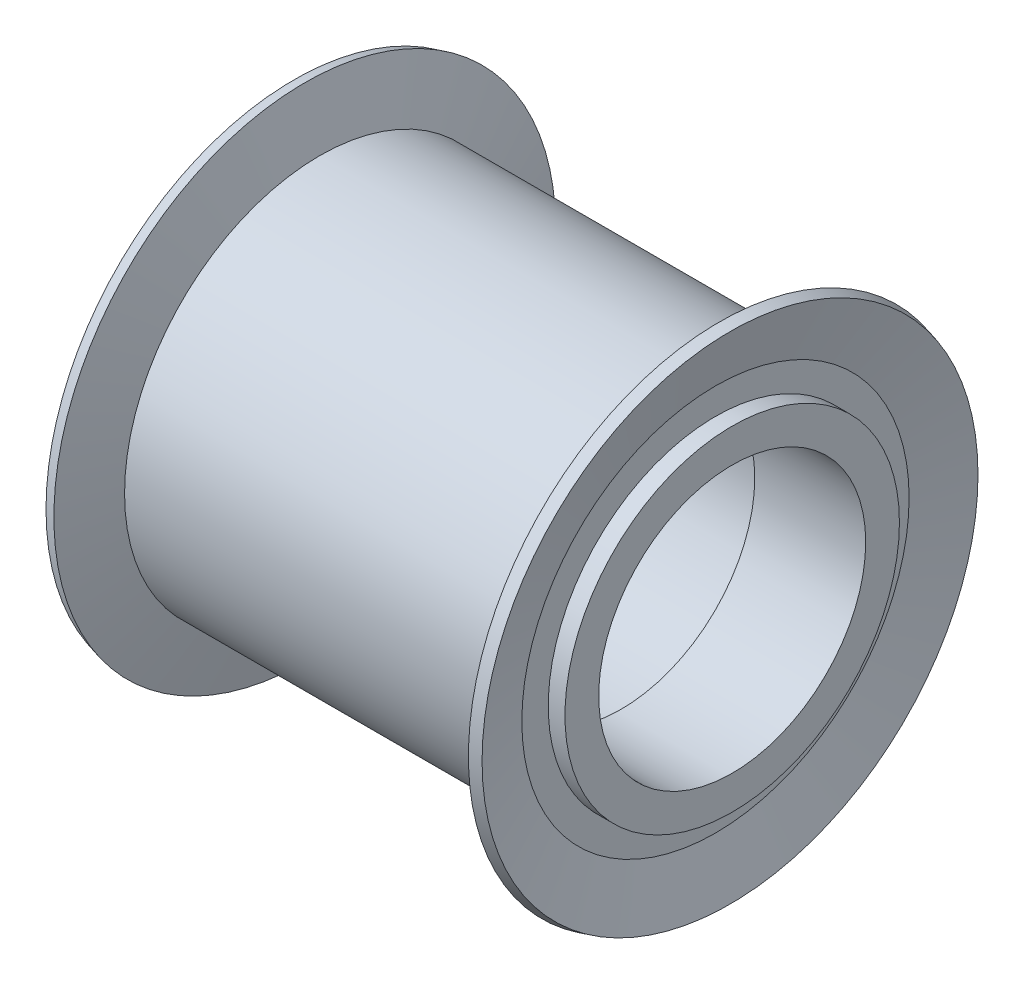
ISO-10303-21;
HEADER;
FILE_DESCRIPTION(('STEP AP214'),'2;1');
FILE_NAME('part.step','',(''),(''),'','','');
FILE_SCHEMA(('AUTOMOTIVE_DESIGN { 1 0 10303 214 1 1 1 1 }'));
ENDSEC;
DATA;
#1=APPLICATION_CONTEXT('core data for automotive mechanical design processes');
#2=APPLICATION_PROTOCOL_DEFINITION('international standard','automotive_design',2000,#1);
#3=PRODUCT_CONTEXT('',#1,'mechanical');
#4=PRODUCT('Part','Part','',(#3));
#5=PRODUCT_RELATED_PRODUCT_CATEGORY('part','',(#4));
#6=PRODUCT_DEFINITION_FORMATION('','',#4);
#7=PRODUCT_DEFINITION_CONTEXT('part definition',#1,'design');
#8=PRODUCT_DEFINITION('design','',#6,#7);
#9=PRODUCT_DEFINITION_SHAPE('','',#8);
#10=(LENGTH_UNIT() NAMED_UNIT(*) SI_UNIT(.MILLI.,.METRE.));
#11=(NAMED_UNIT(*) PLANE_ANGLE_UNIT() SI_UNIT($,.RADIAN.));
#12=(NAMED_UNIT(*) SI_UNIT($,.STERADIAN.) SOLID_ANGLE_UNIT());
#13=UNCERTAINTY_MEASURE_WITH_UNIT(LENGTH_MEASURE(1.E-05),#10,'distance_accuracy_value','');
#14=(GEOMETRIC_REPRESENTATION_CONTEXT(3) GLOBAL_UNCERTAINTY_ASSIGNED_CONTEXT((#13)) GLOBAL_UNIT_ASSIGNED_CONTEXT((#10,
#11,#12)) REPRESENTATION_CONTEXT('',''));
#15=CARTESIAN_POINT('',(0.,0.,0.));
#16=DIRECTION('',(0.,0.,1.));
#17=DIRECTION('',(1.,0.,0.));
#18=AXIS2_PLACEMENT_3D('',#15,#16,#17);
#19=CARTESIAN_POINT('',(-4.1304347826087,7.55145543583174,0.));
#20=DIRECTION('',(-1.,0.,0.));
#21=DIRECTION('',(0.,0.,1.));
#22=AXIS2_PLACEMENT_3D('',#19,#20,#21);
#23=PLANE('',#22);
#24=CARTESIAN_POINT('',(-4.1304347826087,0.,0.));
#25=DIRECTION('',(1.,0.,0.));
#26=DIRECTION('',(0.,0.,-1.));
#27=AXIS2_PLACEMENT_3D('',#24,#25,#26);
#28=CIRCLE('',#27,6.52173913043478);
#29=CARTESIAN_POINT('',(-4.1304347826087,0.,-6.52173913043478));
#30=VERTEX_POINT('',#29);
#31=EDGE_CURVE('E99',#30,#30,#28,.T.);
#32=ORIENTED_EDGE('',*,*,#31,.T.);
#33=EDGE_LOOP('',(#32));
#34=FACE_BOUND('',#33,.T.);
#35=CARTESIAN_POINT('',(-4.1304347826087,0.,0.));
#36=DIRECTION('',(1.,0.,0.));
#37=DIRECTION('',(0.,0.,-1.));
#38=AXIS2_PLACEMENT_3D('',#35,#36,#37);
#39=CIRCLE('',#38,7.55145543583174);
#40=CARTESIAN_POINT('',(-4.1304347826087,0.,-7.55145543583174));
#41=VERTEX_POINT('',#40);
#42=EDGE_CURVE('E10',#41,#41,#39,.T.);
#43=ORIENTED_EDGE('',*,*,#42,.F.);
#44=EDGE_LOOP('',(#43));
#45=FACE_BOUND('',#44,.T.);
#46=ADVANCED_FACE('F35',(#34,#45),#23,.T.);
#47=CARTESIAN_POINT('',(-4.69811816888913,0.,0.));
#48=DIRECTION('',(-1.,0.,0.));
#49=DIRECTION('',(0.,0.,1.));
#50=AXIS2_PLACEMENT_3D('',#47,#48,#49);
#51=CONICAL_SURFACE('',#50,9.67007867604217,1.30899693899564);
#52=ORIENTED_EDGE('',*,*,#42,.T.);
#53=EDGE_LOOP('',(#52));
#54=FACE_BOUND('',#53,.T.);
#55=CARTESIAN_POINT('',(-4.69811816888913,0.,0.));
#56=DIRECTION('',(1.,0.,0.));
#57=DIRECTION('',(0.,0.,-1.));
#58=AXIS2_PLACEMENT_3D('',#55,#56,#57);
#59=CIRCLE('',#58,9.67007867604217);
#60=CARTESIAN_POINT('',(-4.69811816888913,0.,-9.67007867604217));
#61=VERTEX_POINT('',#60);
#62=EDGE_CURVE('E41',#61,#61,#59,.T.);
#63=ORIENTED_EDGE('',*,*,#62,.F.);
#64=EDGE_LOOP('',(#63));
#65=FACE_BOUND('',#64,.T.);
#66=ADVANCED_FACE('F117',(#54,#65),#51,.F.);
#67=CARTESIAN_POINT('',(-4.27815041832849,0.,0.));
#68=DIRECTION('',(1.,0.,0.));
#69=DIRECTION('',(0.,0.,-1.));
#70=AXIS2_PLACEMENT_3D('',#67,#68,#69);
#71=CONICAL_SURFACE('',#70,9.78260869565206,0.261799387799257);
#72=ORIENTED_EDGE('',*,*,#62,.T.);
#73=EDGE_LOOP('',(#72));
#74=FACE_BOUND('',#73,.T.);
#75=CARTESIAN_POINT('',(-4.27815041832849,0.,0.));
#76=DIRECTION('',(1.,0.,0.));
#77=DIRECTION('',(0.,0.,-1.));
#78=AXIS2_PLACEMENT_3D('',#75,#76,#77);
#79=CIRCLE('',#78,9.78260869565206);
#80=CARTESIAN_POINT('',(-4.27815041832849,0.,-9.78260869565206));
#81=VERTEX_POINT('',#80);
#82=EDGE_CURVE('E45',#81,#81,#79,.T.);
#83=ORIENTED_EDGE('',*,*,#82,.F.);
#84=EDGE_LOOP('',(#83));
#85=FACE_BOUND('',#84,.T.);
#86=ADVANCED_FACE('F121',(#74,#85),#71,.T.);
#87=CARTESIAN_POINT('',(-3.69565217391278,0.,0.));
#88=DIRECTION('',(-1.,0.,0.));
#89=DIRECTION('',(0.,0.,1.));
#90=AXIS2_PLACEMENT_3D('',#87,#88,#89);
#91=CONICAL_SURFACE('',#90,7.60869565217388,1.30899693899564);
#92=ORIENTED_EDGE('',*,*,#82,.T.);
#93=EDGE_LOOP('',(#92));
#94=FACE_BOUND('',#93,.T.);
#95=CARTESIAN_POINT('',(-3.69565217391278,0.,0.));
#96=DIRECTION('',(1.,0.,0.));
#97=DIRECTION('',(0.,0.,-1.));
#98=AXIS2_PLACEMENT_3D('',#95,#96,#97);
#99=CIRCLE('',#98,7.60869565217388);
#100=CARTESIAN_POINT('',(-3.69565217391278,0.,-7.60869565217388));
#101=VERTEX_POINT('',#100);
#102=EDGE_CURVE('E49',#101,#101,#99,.T.);
#103=ORIENTED_EDGE('',*,*,#102,.F.);
#104=EDGE_LOOP('',(#103));
#105=FACE_BOUND('',#104,.T.);
#106=ADVANCED_FACE('F125',(#94,#105),#91,.T.);
#107=CARTESIAN_POINT('',(-4.78478260869566,0.,0.));
#108=DIRECTION('',(1.,0.,0.));
#109=DIRECTION('',(0.,0.,-1.));
#110=AXIS2_PLACEMENT_3D('',#107,#108,#109);
#111=CYLINDRICAL_SURFACE('',#110,7.60869565217388);
#112=ORIENTED_EDGE('',*,*,#102,.T.);
#113=EDGE_LOOP('',(#112));
#114=FACE_BOUND('',#113,.T.);
#115=CARTESIAN_POINT('',(11.3043478260872,0.,0.));
#116=DIRECTION('',(1.,0.,0.));
#117=DIRECTION('',(0.,0.,-1.));
#118=AXIS2_PLACEMENT_3D('',#115,#116,#117);
#119=CIRCLE('',#118,7.60869565217388);
#120=CARTESIAN_POINT('',(11.3043478260872,0.,-7.60869565217388));
#121=VERTEX_POINT('',#120);
#122=EDGE_CURVE('E54',#121,#121,#119,.T.);
#123=ORIENTED_EDGE('',*,*,#122,.F.);
#124=EDGE_LOOP('',(#123));
#125=FACE_BOUND('',#124,.T.);
#126=ADVANCED_FACE('F131',(#114,#125),#111,.T.);
#127=CARTESIAN_POINT('',(11.8868460705029,0.,0.));
#128=DIRECTION('',(1.,0.,0.));
#129=DIRECTION('',(0.,0.,-1.));
#130=AXIS2_PLACEMENT_3D('',#127,#128,#129);
#131=CONICAL_SURFACE('',#130,9.78260869565207,1.30899693899564);
#132=ORIENTED_EDGE('',*,*,#122,.T.);
#133=EDGE_LOOP('',(#132));
#134=FACE_BOUND('',#133,.T.);
#135=CARTESIAN_POINT('',(11.8868460705029,0.,0.));
#136=DIRECTION('',(1.,0.,0.));
#137=DIRECTION('',(0.,0.,-1.));
#138=AXIS2_PLACEMENT_3D('',#135,#136,#137);
#139=CIRCLE('',#138,9.78260869565207);
#140=CARTESIAN_POINT('',(11.8868460705029,0.,-9.78260869565207));
#141=VERTEX_POINT('',#140);
#142=EDGE_CURVE('E57',#141,#141,#139,.T.);
#143=ORIENTED_EDGE('',*,*,#142,.F.);
#144=EDGE_LOOP('',(#143));
#145=FACE_BOUND('',#144,.T.);
#146=ADVANCED_FACE('F135',(#134,#145),#131,.T.);
#147=CARTESIAN_POINT('',(12.306813821063,0.,0.));
#148=DIRECTION('',(-1.,0.,0.));
#149=DIRECTION('',(0.,0.,1.));
#150=AXIS2_PLACEMENT_3D('',#147,#148,#149);
#151=CONICAL_SURFACE('',#150,9.67007867604234,0.26179938779925);
#152=ORIENTED_EDGE('',*,*,#142,.T.);
#153=EDGE_LOOP('',(#152));
#154=FACE_BOUND('',#153,.T.);
#155=CARTESIAN_POINT('',(12.306813821063,0.,0.));
#156=DIRECTION('',(1.,0.,0.));
#157=DIRECTION('',(0.,0.,-1.));
#158=AXIS2_PLACEMENT_3D('',#155,#156,#157);
#159=CIRCLE('',#158,9.67007867604234);
#160=CARTESIAN_POINT('',(12.306813821063,0.,-9.67007867604234));
#161=VERTEX_POINT('',#160);
#162=EDGE_CURVE('E60',#161,#161,#159,.T.);
#163=ORIENTED_EDGE('',*,*,#162,.F.);
#164=EDGE_LOOP('',(#163));
#165=FACE_BOUND('',#164,.T.);
#166=ADVANCED_FACE('F139',(#154,#165),#151,.T.);
#167=CARTESIAN_POINT('',(11.7391304347825,0.,0.));
#168=DIRECTION('',(1.,0.,0.));
#169=DIRECTION('',(0.,0.,-1.));
#170=AXIS2_PLACEMENT_3D('',#167,#168,#169);
#171=CONICAL_SURFACE('',#170,7.55145543583174,1.30899693899564);
#172=ORIENTED_EDGE('',*,*,#162,.T.);
#173=EDGE_LOOP('',(#172));
#174=FACE_BOUND('',#173,.T.);
#175=CARTESIAN_POINT('',(11.7391304347825,0.,0.));
#176=DIRECTION('',(1.,0.,0.));
#177=DIRECTION('',(0.,0.,-1.));
#178=AXIS2_PLACEMENT_3D('',#175,#176,#177);
#179=CIRCLE('',#178,7.55145543583174);
#180=CARTESIAN_POINT('',(11.7391304347825,0.,-7.55145543583174));
#181=VERTEX_POINT('',#180);
#182=EDGE_CURVE('E63',#181,#181,#179,.T.);
#183=ORIENTED_EDGE('',*,*,#182,.F.);
#184=EDGE_LOOP('',(#183));
#185=FACE_BOUND('',#184,.T.);
#186=ADVANCED_FACE('F143',(#174,#185),#171,.F.);
#187=CARTESIAN_POINT('',(11.7391304347825,6.52173913043478,0.));
#188=DIRECTION('',(1.,0.,0.));
#189=DIRECTION('',(0.,0.,-1.));
#190=AXIS2_PLACEMENT_3D('',#187,#188,#189);
#191=PLANE('',#190);
#192=ORIENTED_EDGE('',*,*,#182,.T.);
#193=EDGE_LOOP('',(#192));
#194=FACE_BOUND('',#193,.T.);
#195=CARTESIAN_POINT('',(11.7391304347825,0.,0.));
#196=DIRECTION('',(1.,0.,0.));
#197=DIRECTION('',(0.,0.,-1.));
#198=AXIS2_PLACEMENT_3D('',#195,#196,#197);
#199=CIRCLE('',#198,6.52173913043478);
#200=CARTESIAN_POINT('',(11.7391304347825,0.,-6.52173913043478));
#201=VERTEX_POINT('',#200);
#202=EDGE_CURVE('E66',#201,#201,#199,.T.);
#203=ORIENTED_EDGE('',*,*,#202,.F.);
#204=EDGE_LOOP('',(#203));
#205=FACE_BOUND('',#204,.T.);
#206=ADVANCED_FACE('F147',(#194,#205),#191,.T.);
#207=CARTESIAN_POINT('',(-4.78478260869566,0.,0.));
#208=DIRECTION('',(1.,0.,0.));
#209=DIRECTION('',(0.,0.,-1.));
#210=AXIS2_PLACEMENT_3D('',#207,#208,#209);
#211=CYLINDRICAL_SURFACE('',#210,6.52173913043478);
#212=ORIENTED_EDGE('',*,*,#202,.T.);
#213=EDGE_LOOP('',(#212));
#214=FACE_BOUND('',#213,.T.);
#215=CARTESIAN_POINT('',(12.391304347826,0.,0.));
#216=DIRECTION('',(1.,0.,0.));
#217=DIRECTION('',(0.,0.,-1.));
#218=AXIS2_PLACEMENT_3D('',#215,#216,#217);
#219=CIRCLE('',#218,6.52173913043478);
#220=CARTESIAN_POINT('',(12.391304347826,0.,-6.52173913043478));
#221=VERTEX_POINT('',#220);
#222=EDGE_CURVE('E69',#221,#221,#219,.T.);
#223=ORIENTED_EDGE('',*,*,#222,.F.);
#224=EDGE_LOOP('',(#223));
#225=FACE_BOUND('',#224,.T.);
#226=ADVANCED_FACE('F151',(#214,#225),#211,.T.);
#227=CARTESIAN_POINT('',(12.391304347826,5.20660848865068,0.));
#228=DIRECTION('',(1.,0.,0.));
#229=DIRECTION('',(0.,0.,-1.));
#230=AXIS2_PLACEMENT_3D('',#227,#228,#229);
#231=PLANE('',#230);
#232=ORIENTED_EDGE('',*,*,#222,.T.);
#233=EDGE_LOOP('',(#232));
#234=FACE_BOUND('',#233,.T.);
#235=CARTESIAN_POINT('',(12.391304347826,0.,0.));
#236=DIRECTION('',(1.,0.,0.));
#237=DIRECTION('',(0.,0.,-1.));
#238=AXIS2_PLACEMENT_3D('',#235,#236,#237);
#239=CIRCLE('',#238,5.20660848865068);
#240=CARTESIAN_POINT('',(12.391304347826,0.,-5.20660848865068));
#241=VERTEX_POINT('',#240);
#242=EDGE_CURVE('E72',#241,#241,#239,.T.);
#243=ORIENTED_EDGE('',*,*,#242,.F.);
#244=EDGE_LOOP('',(#243));
#245=FACE_BOUND('',#244,.T.);
#246=ADVANCED_FACE('F155',(#234,#245),#231,.T.);
#247=CARTESIAN_POINT('',(-4.78478260869566,0.,0.));
#248=DIRECTION('',(1.,0.,0.));
#249=DIRECTION('',(0.,0.,-1.));
#250=AXIS2_PLACEMENT_3D('',#247,#248,#249);
#251=CYLINDRICAL_SURFACE('',#250,5.20660848865068);
#252=ORIENTED_EDGE('',*,*,#242,.T.);
#253=EDGE_LOOP('',(#252));
#254=FACE_BOUND('',#253,.T.);
#255=CARTESIAN_POINT('',(8.06434782608722,0.,0.));
#256=DIRECTION('',(1.,0.,0.));
#257=DIRECTION('',(0.,0.,-1.));
#258=AXIS2_PLACEMENT_3D('',#255,#256,#257);
#259=CIRCLE('',#258,5.20660848865068);
#260=CARTESIAN_POINT('',(8.06434782608722,0.,-5.20660848865068));
#261=VERTEX_POINT('',#260);
#262=EDGE_CURVE('E75',#261,#261,#259,.T.);
#263=ORIENTED_EDGE('',*,*,#262,.F.);
#264=EDGE_LOOP('',(#263));
#265=FACE_BOUND('',#264,.T.);
#266=ADVANCED_FACE('F159',(#254,#265),#251,.F.);
#267=CARTESIAN_POINT('',(8.06434782608722,5.65217391304348,0.));
#268=DIRECTION('',(-1.,0.,0.));
#269=DIRECTION('',(0.,0.,1.));
#270=AXIS2_PLACEMENT_3D('',#267,#268,#269);
#271=PLANE('',#270);
#272=ORIENTED_EDGE('',*,*,#262,.T.);
#273=EDGE_LOOP('',(#272));
#274=FACE_BOUND('',#273,.T.);
#275=CARTESIAN_POINT('',(8.06434782608722,0.,0.));
#276=DIRECTION('',(1.,0.,0.));
#277=DIRECTION('',(0.,0.,-1.));
#278=AXIS2_PLACEMENT_3D('',#275,#276,#277);
#279=CIRCLE('',#278,5.65217391304348);
#280=CARTESIAN_POINT('',(8.06434782608722,0.,-5.65217391304348));
#281=VERTEX_POINT('',#280);
#282=EDGE_CURVE('E78',#281,#281,#279,.T.);
#283=ORIENTED_EDGE('',*,*,#282,.F.);
#284=EDGE_LOOP('',(#283));
#285=FACE_BOUND('',#284,.T.);
#286=ADVANCED_FACE('F163',(#274,#285),#271,.T.);
#287=CARTESIAN_POINT('',(-4.78478260869566,0.,0.));
#288=DIRECTION('',(1.,0.,0.));
#289=DIRECTION('',(0.,0.,-1.));
#290=AXIS2_PLACEMENT_3D('',#287,#288,#289);
#291=CYLINDRICAL_SURFACE('',#290,5.65217391304348);
#292=ORIENTED_EDGE('',*,*,#282,.T.);
#293=EDGE_LOOP('',(#292));
#294=FACE_BOUND('',#293,.T.);
#295=CARTESIAN_POINT('',(4.06434782608722,0.,0.));
#296=DIRECTION('',(1.,0.,0.));
#297=DIRECTION('',(0.,0.,-1.));
#298=AXIS2_PLACEMENT_3D('',#295,#296,#297);
#299=CIRCLE('',#298,5.65217391304348);
#300=CARTESIAN_POINT('',(4.06434782608722,0.,-5.65217391304348));
#301=VERTEX_POINT('',#300);
#302=EDGE_CURVE('E81',#301,#301,#299,.T.);
#303=ORIENTED_EDGE('',*,*,#302,.F.);
#304=EDGE_LOOP('',(#303));
#305=FACE_BOUND('',#304,.T.);
#306=ADVANCED_FACE('F167',(#294,#305),#291,.F.);
#307=CARTESIAN_POINT('',(4.06434782608722,5.65217391304348,0.));
#308=DIRECTION('',(-1.,0.,0.));
#309=DIRECTION('',(0.,0.,1.));
#310=AXIS2_PLACEMENT_3D('',#307,#308,#309);
#311=PLANE('',#310);
#312=ORIENTED_EDGE('',*,*,#302,.T.);
#313=EDGE_LOOP('',(#312));
#314=FACE_BOUND('',#313,.T.);
#315=CARTESIAN_POINT('',(4.06434782608722,0.,0.));
#316=DIRECTION('',(1.,0.,0.));
#317=DIRECTION('',(0.,0.,-1.));
#318=AXIS2_PLACEMENT_3D('',#315,#316,#317);
#319=CIRCLE('',#318,5.91304347826088);
#320=CARTESIAN_POINT('',(4.06434782608722,0.,-5.91304347826088));
#321=VERTEX_POINT('',#320);
#322=EDGE_CURVE('E84',#321,#321,#319,.T.);
#323=ORIENTED_EDGE('',*,*,#322,.F.);
#324=EDGE_LOOP('',(#323));
#325=FACE_BOUND('',#324,.T.);
#326=ADVANCED_FACE('F171',(#314,#325),#311,.T.);
#327=CARTESIAN_POINT('',(-4.78478260869566,0.,0.));
#328=DIRECTION('',(1.,0.,0.));
#329=DIRECTION('',(0.,0.,-1.));
#330=AXIS2_PLACEMENT_3D('',#327,#328,#329);
#331=CYLINDRICAL_SURFACE('',#330,5.91304347826088);
#332=ORIENTED_EDGE('',*,*,#322,.T.);
#333=EDGE_LOOP('',(#332));
#334=FACE_BOUND('',#333,.T.);
#335=CARTESIAN_POINT('',(3.54434782608722,0.,0.));
#336=DIRECTION('',(1.,0.,0.));
#337=DIRECTION('',(0.,0.,-1.));
#338=AXIS2_PLACEMENT_3D('',#335,#336,#337);
#339=CIRCLE('',#338,5.91304347826088);
#340=CARTESIAN_POINT('',(3.54434782608722,0.,-5.91304347826088));
#341=VERTEX_POINT('',#340);
#342=EDGE_CURVE('E87',#341,#341,#339,.T.);
#343=ORIENTED_EDGE('',*,*,#342,.F.);
#344=EDGE_LOOP('',(#343));
#345=FACE_BOUND('',#344,.T.);
#346=ADVANCED_FACE('F175',(#334,#345),#331,.F.);
#347=CARTESIAN_POINT('',(3.54434782608722,5.91304347826088,0.));
#348=DIRECTION('',(1.,0.,0.));
#349=DIRECTION('',(0.,0.,-1.));
#350=AXIS2_PLACEMENT_3D('',#347,#348,#349);
#351=PLANE('',#350);
#352=ORIENTED_EDGE('',*,*,#342,.T.);
#353=EDGE_LOOP('',(#352));
#354=FACE_BOUND('',#353,.T.);
#355=CARTESIAN_POINT('',(3.54434782608722,0.,0.));
#356=DIRECTION('',(1.,0.,0.));
#357=DIRECTION('',(0.,0.,-1.));
#358=AXIS2_PLACEMENT_3D('',#355,#356,#357);
#359=CIRCLE('',#358,5.65217391304348);
#360=CARTESIAN_POINT('',(3.54434782608722,0.,-5.65217391304348));
#361=VERTEX_POINT('',#360);
#362=EDGE_CURVE('E90',#361,#361,#359,.T.);
#363=ORIENTED_EDGE('',*,*,#362,.F.);
#364=EDGE_LOOP('',(#363));
#365=FACE_BOUND('',#364,.T.);
#366=ADVANCED_FACE('F179',(#354,#365),#351,.T.);
#367=CARTESIAN_POINT('',(-4.78478260869566,0.,0.));
#368=DIRECTION('',(1.,0.,0.));
#369=DIRECTION('',(0.,0.,-1.));
#370=AXIS2_PLACEMENT_3D('',#367,#368,#369);
#371=CYLINDRICAL_SURFACE('',#370,5.65217391304348);
#372=ORIENTED_EDGE('',*,*,#362,.T.);
#373=EDGE_LOOP('',(#372));
#374=FACE_BOUND('',#373,.T.);
#375=CARTESIAN_POINT('',(-4.78260869565217,0.,0.));
#376=DIRECTION('',(1.,0.,0.));
#377=DIRECTION('',(0.,0.,-1.));
#378=AXIS2_PLACEMENT_3D('',#375,#376,#377);
#379=CIRCLE('',#378,5.65217391304348);
#380=CARTESIAN_POINT('',(-4.78260869565217,0.,-5.65217391304348));
#381=VERTEX_POINT('',#380);
#382=EDGE_CURVE('E93',#381,#381,#379,.T.);
#383=ORIENTED_EDGE('',*,*,#382,.F.);
#384=EDGE_LOOP('',(#383));
#385=FACE_BOUND('',#384,.T.);
#386=ADVANCED_FACE('F113',(#374,#385),#371,.F.);
#387=CARTESIAN_POINT('',(-4.78260869565217,6.52173913043478,0.));
#388=DIRECTION('',(-1.,0.,0.));
#389=DIRECTION('',(0.,0.,1.));
#390=AXIS2_PLACEMENT_3D('',#387,#388,#389);
#391=PLANE('',#390);
#392=ORIENTED_EDGE('',*,*,#382,.T.);
#393=EDGE_LOOP('',(#392));
#394=FACE_BOUND('',#393,.T.);
#395=CARTESIAN_POINT('',(-4.78260869565217,0.,0.));
#396=DIRECTION('',(1.,0.,0.));
#397=DIRECTION('',(0.,0.,-1.));
#398=AXIS2_PLACEMENT_3D('',#395,#396,#397);
#399=CIRCLE('',#398,6.52173913043478);
#400=CARTESIAN_POINT('',(-4.78260869565217,0.,-6.52173913043478));
#401=VERTEX_POINT('',#400);
#402=EDGE_CURVE('E96',#401,#401,#399,.T.);
#403=ORIENTED_EDGE('',*,*,#402,.F.);
#404=EDGE_LOOP('',(#403));
#405=FACE_BOUND('',#404,.T.);
#406=ADVANCED_FACE('F107',(#394,#405),#391,.T.);
#407=CARTESIAN_POINT('',(-4.78478260869566,0.,0.));
#408=DIRECTION('',(1.,0.,0.));
#409=DIRECTION('',(0.,0.,-1.));
#410=AXIS2_PLACEMENT_3D('',#407,#408,#409);
#411=CYLINDRICAL_SURFACE('',#410,6.52173913043478);
#412=ORIENTED_EDGE('',*,*,#402,.T.);
#413=EDGE_LOOP('',(#412));
#414=FACE_BOUND('',#413,.T.);
#415=ORIENTED_EDGE('',*,*,#31,.F.);
#416=EDGE_LOOP('',(#415));
#417=FACE_BOUND('',#416,.T.);
#418=ADVANCED_FACE('F105',(#414,#417),#411,.T.);
#419=CLOSED_SHELL('',(#46,#66,#86,#106,#126,#146,#166,#186,#206,#226,#246,#266,#286,#306,#326,
#346,#366,#386,#406,#418));
#420=MANIFOLD_SOLID_BREP('B2',#419);
#421=ADVANCED_BREP_SHAPE_REPRESENTATION('',(#18,#420),#14);
#422=SHAPE_DEFINITION_REPRESENTATION(#9,#421);
ENDSEC;
END-ISO-10303-21;
